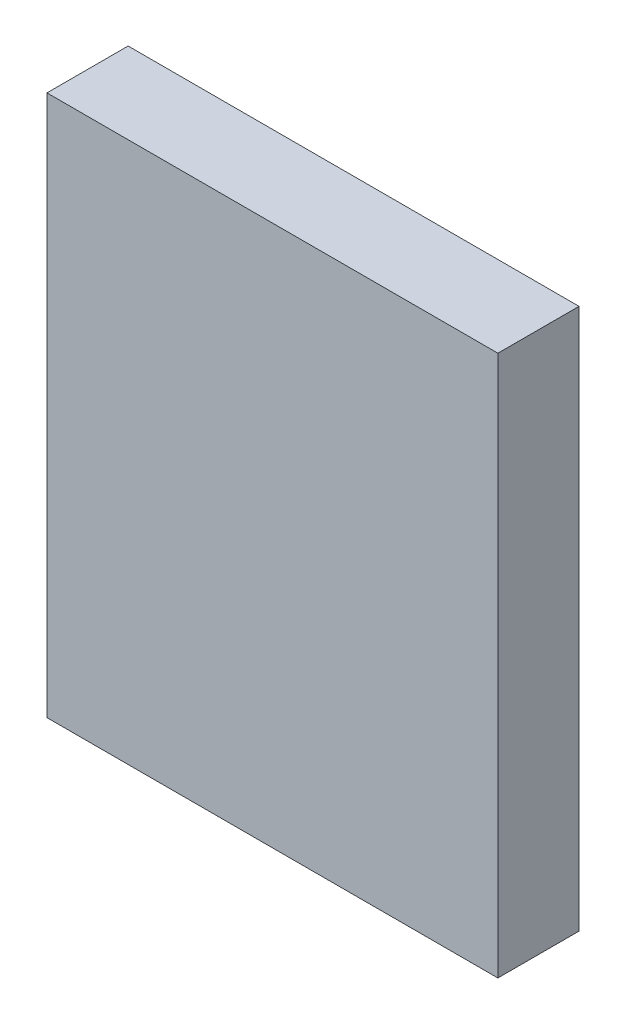
ISO-10303-21;
HEADER;
FILE_DESCRIPTION(('STEP AP214'),'2;1');
FILE_NAME('part.step','',(''),(''),'','','');
FILE_SCHEMA(('AUTOMOTIVE_DESIGN { 1 0 10303 214 1 1 1 1 }'));
ENDSEC;
DATA;
#1=APPLICATION_CONTEXT('core data for automotive mechanical design processes');
#2=APPLICATION_PROTOCOL_DEFINITION('international standard','automotive_design',2000,#1);
#3=PRODUCT_CONTEXT('',#1,'mechanical');
#4=PRODUCT('Part','Part','',(#3));
#5=PRODUCT_RELATED_PRODUCT_CATEGORY('part','',(#4));
#6=PRODUCT_DEFINITION_FORMATION('','',#4);
#7=PRODUCT_DEFINITION_CONTEXT('part definition',#1,'design');
#8=PRODUCT_DEFINITION('design','',#6,#7);
#9=PRODUCT_DEFINITION_SHAPE('','',#8);
#10=(LENGTH_UNIT() NAMED_UNIT(*) SI_UNIT(.MILLI.,.METRE.));
#11=(NAMED_UNIT(*) PLANE_ANGLE_UNIT() SI_UNIT($,.RADIAN.));
#12=(NAMED_UNIT(*) SI_UNIT($,.STERADIAN.) SOLID_ANGLE_UNIT());
#13=UNCERTAINTY_MEASURE_WITH_UNIT(LENGTH_MEASURE(1.E-05),#10,'distance_accuracy_value','');
#14=(GEOMETRIC_REPRESENTATION_CONTEXT(3) GLOBAL_UNCERTAINTY_ASSIGNED_CONTEXT((#13)) GLOBAL_UNIT_ASSIGNED_CONTEXT((#10,
#11,#12)) REPRESENTATION_CONTEXT('',''));
#15=CARTESIAN_POINT('',(0.,0.,0.));
#16=DIRECTION('',(0.,0.,1.));
#17=DIRECTION('',(1.,0.,0.));
#18=AXIS2_PLACEMENT_3D('',#15,#16,#17);
#19=CARTESIAN_POINT('',(50.,60.,18.));
#20=DIRECTION('',(-1.,0.,0.));
#21=DIRECTION('',(0.,-1.,0.));
#22=AXIS2_PLACEMENT_3D('',#19,#20,#21);
#23=PLANE('',#22);
#24=DIRECTION('',(0.,1.,0.));
#25=VECTOR('',#24,1.);
#26=CARTESIAN_POINT('',(50.,60.,0.));
#27=LINE('',#26,#25);
#28=CARTESIAN_POINT('',(50.,-60.,0.));
#29=VERTEX_POINT('',#28);
#30=CARTESIAN_POINT('',(50.,60.,0.));
#31=VERTEX_POINT('',#30);
#32=EDGE_CURVE('E96',#29,#31,#27,.T.);
#33=ORIENTED_EDGE('',*,*,#32,.T.);
#34=DIRECTION('',(0.,0.,-1.));
#35=VECTOR('',#34,1.);
#36=CARTESIAN_POINT('',(50.,60.,18.));
#37=LINE('',#36,#35);
#38=CARTESIAN_POINT('',(50.,60.,18.));
#39=VERTEX_POINT('',#38);
#40=EDGE_CURVE('E11',#39,#31,#37,.T.);
#41=ORIENTED_EDGE('',*,*,#40,.F.);
#42=DIRECTION('',(0.,1.,0.));
#43=VECTOR('',#42,1.);
#44=CARTESIAN_POINT('',(50.,60.,18.));
#45=LINE('',#44,#43);
#46=CARTESIAN_POINT('',(50.,-60.,18.));
#47=VERTEX_POINT('',#46);
#48=EDGE_CURVE('E84',#47,#39,#45,.T.);
#49=ORIENTED_EDGE('',*,*,#48,.F.);
#50=DIRECTION('',(0.,0.,-1.));
#51=VECTOR('',#50,1.);
#52=CARTESIAN_POINT('',(50.,-60.,18.));
#53=LINE('',#52,#51);
#54=EDGE_CURVE('E92',#47,#29,#53,.T.);
#55=ORIENTED_EDGE('',*,*,#54,.T.);
#56=EDGE_LOOP('',(#33,#41,#49,#55));
#57=FACE_BOUND('',#56,.T.);
#58=ADVANCED_FACE('F33',(#57),#23,.F.);
#59=CARTESIAN_POINT('',(-50.,60.,18.));
#60=DIRECTION('',(0.,-1.,0.));
#61=DIRECTION('',(0.,0.,-1.));
#62=AXIS2_PLACEMENT_3D('',#59,#60,#61);
#63=PLANE('',#62);
#64=DIRECTION('',(-1.,0.,0.));
#65=VECTOR('',#64,1.);
#66=CARTESIAN_POINT('',(-50.,60.,0.));
#67=LINE('',#66,#65);
#68=CARTESIAN_POINT('',(-50.,60.,0.));
#69=VERTEX_POINT('',#68);
#70=EDGE_CURVE('E88',#31,#69,#67,.T.);
#71=ORIENTED_EDGE('',*,*,#70,.T.);
#72=DIRECTION('',(0.,0.,-1.));
#73=VECTOR('',#72,1.);
#74=CARTESIAN_POINT('',(-50.,60.,18.));
#75=LINE('',#74,#73);
#76=CARTESIAN_POINT('',(-50.,60.,18.));
#77=VERTEX_POINT('',#76);
#78=EDGE_CURVE('E41',#77,#69,#75,.T.);
#79=ORIENTED_EDGE('',*,*,#78,.F.);
#80=DIRECTION('',(-1.,0.,0.));
#81=VECTOR('',#80,1.);
#82=CARTESIAN_POINT('',(-50.,60.,18.));
#83=LINE('',#82,#81);
#84=EDGE_CURVE('E79',#39,#77,#83,.T.);
#85=ORIENTED_EDGE('',*,*,#84,.F.);
#86=ORIENTED_EDGE('',*,*,#40,.T.);
#87=EDGE_LOOP('',(#71,#79,#85,#86));
#88=FACE_BOUND('',#87,.T.);
#89=ADVANCED_FACE('F87',(#88),#63,.F.);
#90=CARTESIAN_POINT('',(-50.,60.,18.));
#91=DIRECTION('',(1.,0.,0.));
#92=DIRECTION('',(0.,1.,0.));
#93=AXIS2_PLACEMENT_3D('',#90,#91,#92);
#94=PLANE('',#93);
#95=DIRECTION('',(0.,-1.,0.));
#96=VECTOR('',#95,1.);
#97=CARTESIAN_POINT('',(-50.,60.,0.));
#98=LINE('',#97,#96);
#99=CARTESIAN_POINT('',(-50.,-60.,0.));
#100=VERTEX_POINT('',#99);
#101=EDGE_CURVE('E66',#69,#100,#98,.T.);
#102=ORIENTED_EDGE('',*,*,#101,.T.);
#103=DIRECTION('',(0.,0.,-1.));
#104=VECTOR('',#103,1.);
#105=CARTESIAN_POINT('',(-50.,-60.,18.));
#106=LINE('',#105,#104);
#107=CARTESIAN_POINT('',(-50.,-60.,18.));
#108=VERTEX_POINT('',#107);
#109=EDGE_CURVE('E89',#108,#100,#106,.T.);
#110=ORIENTED_EDGE('',*,*,#109,.F.);
#111=DIRECTION('',(0.,-1.,0.));
#112=VECTOR('',#111,1.);
#113=CARTESIAN_POINT('',(-50.,60.,18.));
#114=LINE('',#113,#112);
#115=EDGE_CURVE('E82',#77,#108,#114,.T.);
#116=ORIENTED_EDGE('',*,*,#115,.F.);
#117=ORIENTED_EDGE('',*,*,#78,.T.);
#118=EDGE_LOOP('',(#102,#110,#116,#117));
#119=FACE_BOUND('',#118,.T.);
#120=ADVANCED_FACE('F90',(#119),#94,.F.);
#121=CARTESIAN_POINT('',(-50.,-60.,18.));
#122=DIRECTION('',(0.,1.,0.));
#123=DIRECTION('',(0.,0.,1.));
#124=AXIS2_PLACEMENT_3D('',#121,#122,#123);
#125=PLANE('',#124);
#126=DIRECTION('',(1.,0.,0.));
#127=VECTOR('',#126,1.);
#128=CARTESIAN_POINT('',(-50.,-60.,0.));
#129=LINE('',#128,#127);
#130=EDGE_CURVE('E72',#100,#29,#129,.T.);
#131=ORIENTED_EDGE('',*,*,#130,.T.);
#132=ORIENTED_EDGE('',*,*,#54,.F.);
#133=DIRECTION('',(1.,0.,0.));
#134=VECTOR('',#133,1.);
#135=CARTESIAN_POINT('',(-50.,-60.,18.));
#136=LINE('',#135,#134);
#137=EDGE_CURVE('E49',#108,#47,#136,.T.);
#138=ORIENTED_EDGE('',*,*,#137,.F.);
#139=ORIENTED_EDGE('',*,*,#109,.T.);
#140=EDGE_LOOP('',(#131,#132,#138,#139));
#141=FACE_BOUND('',#140,.T.);
#142=ADVANCED_FACE('F103',(#141),#125,.F.);
#143=CARTESIAN_POINT('',(0.,0.,18.));
#144=DIRECTION('',(0.,0.,1.));
#145=DIRECTION('',(1.,0.,0.));
#146=AXIS2_PLACEMENT_3D('',#143,#144,#145);
#147=PLANE('',#146);
#148=ORIENTED_EDGE('',*,*,#48,.T.);
#149=ORIENTED_EDGE('',*,*,#84,.T.);
#150=ORIENTED_EDGE('',*,*,#115,.T.);
#151=ORIENTED_EDGE('',*,*,#137,.T.);
#152=EDGE_LOOP('',(#148,#149,#150,#151));
#153=FACE_BOUND('',#152,.T.);
#154=ADVANCED_FACE('F80',(#153),#147,.T.);
#155=CARTESIAN_POINT('',(0.,0.,0.));
#156=DIRECTION('',(0.,0.,1.));
#157=DIRECTION('',(1.,0.,0.));
#158=AXIS2_PLACEMENT_3D('',#155,#156,#157);
#159=PLANE('',#158);
#160=ORIENTED_EDGE('',*,*,#32,.F.);
#161=ORIENTED_EDGE('',*,*,#130,.F.);
#162=ORIENTED_EDGE('',*,*,#101,.F.);
#163=ORIENTED_EDGE('',*,*,#70,.F.);
#164=EDGE_LOOP('',(#160,#161,#162,#163));
#165=FACE_BOUND('',#164,.T.);
#166=ADVANCED_FACE('F106',(#165),#159,.F.);
#167=CLOSED_SHELL('',(#58,#89,#120,#142,#154,#166));
#168=MANIFOLD_SOLID_BREP('B2',#167);
#169=ADVANCED_BREP_SHAPE_REPRESENTATION('',(#18,#168),#14);
#170=SHAPE_DEFINITION_REPRESENTATION(#9,#169);
ENDSEC;
END-ISO-10303-21;
